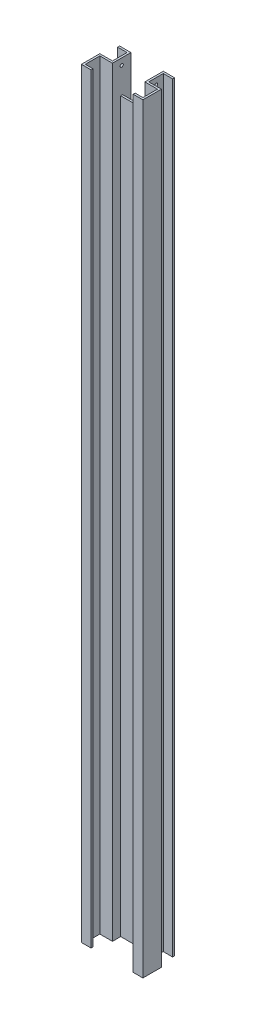
ISO-10303-21;
HEADER;
FILE_DESCRIPTION(('STEP AP214'),'2;1');
FILE_NAME('part.step','',(''),(''),'','','');
FILE_SCHEMA(('AUTOMOTIVE_DESIGN { 1 0 10303 214 1 1 1 1 }'));
ENDSEC;
DATA;
#1=APPLICATION_CONTEXT('core data for automotive mechanical design processes');
#2=APPLICATION_PROTOCOL_DEFINITION('international standard','automotive_design',2000,#1);
#3=PRODUCT_CONTEXT('',#1,'mechanical');
#4=PRODUCT('Part','Part','',(#3));
#5=PRODUCT_RELATED_PRODUCT_CATEGORY('part','',(#4));
#6=PRODUCT_DEFINITION_FORMATION('','',#4);
#7=PRODUCT_DEFINITION_CONTEXT('part definition',#1,'design');
#8=PRODUCT_DEFINITION('design','',#6,#7);
#9=PRODUCT_DEFINITION_SHAPE('','',#8);
#10=(LENGTH_UNIT() NAMED_UNIT(*) SI_UNIT(.MILLI.,.METRE.));
#11=(NAMED_UNIT(*) PLANE_ANGLE_UNIT() SI_UNIT($,.RADIAN.));
#12=(NAMED_UNIT(*) SI_UNIT($,.STERADIAN.) SOLID_ANGLE_UNIT());
#13=UNCERTAINTY_MEASURE_WITH_UNIT(LENGTH_MEASURE(1.E-05),#10,'distance_accuracy_value','');
#14=(GEOMETRIC_REPRESENTATION_CONTEXT(3) GLOBAL_UNCERTAINTY_ASSIGNED_CONTEXT((#13)) GLOBAL_UNIT_ASSIGNED_CONTEXT((#10,
#11,#12)) REPRESENTATION_CONTEXT('',''));
#15=CARTESIAN_POINT('',(0.,0.,0.));
#16=DIRECTION('',(0.,0.,1.));
#17=DIRECTION('',(1.,0.,0.));
#18=AXIS2_PLACEMENT_3D('',#15,#16,#17);
#19=CARTESIAN_POINT('',(-56.,-5.00000001402157E-05,-51.));
#20=DIRECTION('',(1.,0.,0.));
#21=DIRECTION('',(0.,0.,-1.));
#22=AXIS2_PLACEMENT_3D('',#19,#20,#21);
#23=PLANE('',#22);
#24=CARTESIAN_POINT('',(-56.,2330.,-73.5));
#25=DIRECTION('',(-1.,0.,0.));
#26=DIRECTION('',(0.,0.,1.));
#27=AXIS2_PLACEMENT_3D('',#24,#25,#26);
#28=CIRCLE('',#27,4.99999999999989);
#29=CARTESIAN_POINT('',(-56.,2330.,-68.5000000000001));
#30=VERTEX_POINT('',#29);
#31=EDGE_CURVE('E562',#30,#30,#28,.T.);
#32=ORIENTED_EDGE('',*,*,#31,.F.);
#33=EDGE_LOOP('',(#32));
#34=FACE_BOUND('',#33,.T.);
#35=DIRECTION('',(0.,1.,0.));
#36=VECTOR('',#35,1.);
#37=CARTESIAN_POINT('',(-56.,2350.,-96.));
#38=LINE('',#37,#36);
#39=CARTESIAN_POINT('',(-56.,0.,-96.));
#40=VERTEX_POINT('',#39);
#41=CARTESIAN_POINT('',(-56.,2350.,-96.));
#42=VERTEX_POINT('',#41);
#43=EDGE_CURVE('E244',#40,#42,#38,.T.);
#44=ORIENTED_EDGE('',*,*,#43,.F.);
#45=DIRECTION('',(0.,0.,1.));
#46=VECTOR('',#45,1.);
#47=CARTESIAN_POINT('',(-56.,0.,-44.9999999999998));
#48=LINE('',#47,#46);
#49=CARTESIAN_POINT('',(-56.,0.,-51.));
#50=VERTEX_POINT('',#49);
#51=EDGE_CURVE('E259',#40,#50,#48,.T.);
#52=ORIENTED_EDGE('',*,*,#51,.T.);
#53=DIRECTION('',(0.,1.,0.));
#54=VECTOR('',#53,1.);
#55=CARTESIAN_POINT('',(-56.,-5.00000001402157E-05,-51.));
#56=LINE('',#55,#54);
#57=CARTESIAN_POINT('',(-56.,2350.,-51.));
#58=VERTEX_POINT('',#57);
#59=EDGE_CURVE('E257',#50,#58,#56,.T.);
#60=ORIENTED_EDGE('',*,*,#59,.T.);
#61=DIRECTION('',(0.,0.,-1.));
#62=VECTOR('',#61,1.);
#63=CARTESIAN_POINT('',(-56.,2350.,-51.));
#64=LINE('',#63,#62);
#65=EDGE_CURVE('E52',#58,#42,#64,.T.);
#66=ORIENTED_EDGE('',*,*,#65,.T.);
#67=EDGE_LOOP('',(#44,#52,#60,#66));
#68=FACE_BOUND('',#67,.T.);
#69=ADVANCED_FACE('F35',(#34,#68),#23,.F.);
#70=CARTESIAN_POINT('',(0.,0.,-76.5));
#71=DIRECTION('',(0.,0.,-1.));
#72=DIRECTION('',(-1.,0.,0.));
#73=AXIS2_PLACEMENT_3D('',#70,#71,#72);
#74=PLANE('',#73);
#75=DIRECTION('',(-1.,0.,0.));
#76=VECTOR('',#75,1.);
#77=CARTESIAN_POINT('',(95.,0.,-76.5));
#78=LINE('',#77,#76);
#79=CARTESIAN_POINT('',(49.9999999999997,0.,-76.5));
#80=VERTEX_POINT('',#79);
#81=CARTESIAN_POINT('',(-50.0000000000004,0.,-76.5000000000002));
#82=VERTEX_POINT('',#81);
#83=EDGE_CURVE('E424',#80,#82,#78,.T.);
#84=ORIENTED_EDGE('',*,*,#83,.T.);
#85=DIRECTION('',(0.,-1.,0.));
#86=VECTOR('',#85,1.);
#87=CARTESIAN_POINT('',(-50.0000000000004,0.,-76.5000000000002));
#88=LINE('',#87,#86);
#89=CARTESIAN_POINT('',(-50.0000000000004,2250.,-76.5000000000002));
#90=VERTEX_POINT('',#89);
#91=EDGE_CURVE('E264',#90,#82,#88,.T.);
#92=ORIENTED_EDGE('',*,*,#91,.F.);
#93=DIRECTION('',(-1.,0.,0.));
#94=VECTOR('',#93,1.);
#95=CARTESIAN_POINT('',(50.,2250.,-76.5));
#96=LINE('',#95,#94);
#97=CARTESIAN_POINT('',(50.,2250.,-76.5));
#98=VERTEX_POINT('',#97);
#99=EDGE_CURVE('E321',#98,#90,#96,.T.);
#100=ORIENTED_EDGE('',*,*,#99,.F.);
#101=DIRECTION('',(0.,1.,0.));
#102=VECTOR('',#101,1.);
#103=CARTESIAN_POINT('',(49.9999999999997,2350.,-76.4999999999998));
#104=LINE('',#103,#102);
#105=EDGE_CURVE('E304',#80,#98,#104,.T.);
#106=ORIENTED_EDGE('',*,*,#105,.F.);
#107=EDGE_LOOP('',(#84,#92,#100,#106));
#108=FACE_BOUND('',#107,.T.);
#109=ADVANCED_FACE('F513',(#108),#74,.T.);
#110=CARTESIAN_POINT('',(56.,2350.,-51.));
#111=DIRECTION('',(-1.,0.,0.));
#112=DIRECTION('',(0.,0.,1.));
#113=AXIS2_PLACEMENT_3D('',#110,#111,#112);
#114=PLANE('',#113);
#115=CARTESIAN_POINT('',(56.,2330.,-73.5));
#116=DIRECTION('',(-1.,0.,0.));
#117=DIRECTION('',(0.,0.,1.));
#118=AXIS2_PLACEMENT_3D('',#115,#116,#117);
#119=CIRCLE('',#118,4.99999999999989);
#120=CARTESIAN_POINT('',(56.,2330.,-68.5000000000001));
#121=VERTEX_POINT('',#120);
#122=EDGE_CURVE('E565',#121,#121,#119,.T.);
#123=ORIENTED_EDGE('',*,*,#122,.T.);
#124=EDGE_LOOP('',(#123));
#125=FACE_BOUND('',#124,.T.);
#126=DIRECTION('',(0.,-1.,0.));
#127=VECTOR('',#126,1.);
#128=CARTESIAN_POINT('',(56.,0.,-96.));
#129=LINE('',#128,#127);
#130=CARTESIAN_POINT('',(56.,2350.,-96.));
#131=VERTEX_POINT('',#130);
#132=CARTESIAN_POINT('',(56.,0.,-96.));
#133=VERTEX_POINT('',#132);
#134=EDGE_CURVE('E60',#131,#133,#129,.T.);
#135=ORIENTED_EDGE('',*,*,#134,.F.);
#136=DIRECTION('',(0.,0.,-1.));
#137=VECTOR('',#136,1.);
#138=CARTESIAN_POINT('',(56.,2350.,-51.));
#139=LINE('',#138,#137);
#140=CARTESIAN_POINT('',(56.,2350.,-51.));
#141=VERTEX_POINT('',#140);
#142=EDGE_CURVE('E295',#141,#131,#139,.T.);
#143=ORIENTED_EDGE('',*,*,#142,.F.);
#144=DIRECTION('',(0.,-1.,0.));
#145=VECTOR('',#144,1.);
#146=CARTESIAN_POINT('',(56.,2350.,-51.));
#147=LINE('',#146,#145);
#148=CARTESIAN_POINT('',(56.,0.,-51.));
#149=VERTEX_POINT('',#148);
#150=EDGE_CURVE('E302',#141,#149,#147,.T.);
#151=ORIENTED_EDGE('',*,*,#150,.T.);
#152=DIRECTION('',(0.,0.,-1.));
#153=VECTOR('',#152,1.);
#154=CARTESIAN_POINT('',(56.,0.,-51.));
#155=LINE('',#154,#153);
#156=EDGE_CURVE('E296',#149,#133,#155,.T.);
#157=ORIENTED_EDGE('',*,*,#156,.T.);
#158=EDGE_LOOP('',(#135,#143,#151,#157));
#159=FACE_BOUND('',#158,.T.);
#160=ADVANCED_FACE('F486',(#125,#159),#114,.F.);
#161=CARTESIAN_POINT('',(49.9999999999999,2350.,-44.9999999999999));
#162=DIRECTION('',(0.,1.,0.));
#163=DIRECTION('',(0.,0.,1.));
#164=AXIS2_PLACEMENT_3D('',#161,#162,#163);
#165=PLANE('',#164);
#166=ORIENTED_EDGE('',*,*,#142,.T.);
#167=DIRECTION('',(-1.,0.,0.));
#168=VECTOR('',#167,1.);
#169=CARTESIAN_POINT('',(85.,2350.,-96.));
#170=LINE('',#169,#168);
#171=CARTESIAN_POINT('',(85.,2350.,-96.));
#172=VERTEX_POINT('',#171);
#173=EDGE_CURVE('E288',#172,#131,#170,.T.);
#174=ORIENTED_EDGE('',*,*,#173,.F.);
#175=DIRECTION('',(0.,0.,1.));
#176=VECTOR('',#175,1.);
#177=CARTESIAN_POINT('',(85.,2350.,-96.));
#178=LINE('',#177,#176);
#179=CARTESIAN_POINT('',(85.,2350.,-102.));
#180=VERTEX_POINT('',#179);
#181=EDGE_CURVE('E277',#180,#172,#178,.T.);
#182=ORIENTED_EDGE('',*,*,#181,.F.);
#183=DIRECTION('',(1.,0.,0.));
#184=VECTOR('',#183,1.);
#185=CARTESIAN_POINT('',(94.9999999999998,2350.,-102.));
#186=LINE('',#185,#184);
#187=CARTESIAN_POINT('',(49.9999999999998,2350.,-102.));
#188=VERTEX_POINT('',#187);
#189=EDGE_CURVE('E311',#188,#180,#186,.T.);
#190=ORIENTED_EDGE('',*,*,#189,.F.);
#191=DIRECTION('',(0.,0.,-1.));
#192=VECTOR('',#191,1.);
#193=CARTESIAN_POINT('',(49.9999999999999,2350.,-44.9999999999999));
#194=LINE('',#193,#192);
#195=CARTESIAN_POINT('',(49.9999999999999,2350.,-44.9999999999999));
#196=VERTEX_POINT('',#195);
#197=EDGE_CURVE('E44',#196,#188,#194,.T.);
#198=ORIENTED_EDGE('',*,*,#197,.F.);
#199=DIRECTION('',(1.,0.,0.));
#200=VECTOR('',#199,1.);
#201=CARTESIAN_POINT('',(49.9999999999999,2350.,-44.9999999999999));
#202=LINE('',#201,#200);
#203=CARTESIAN_POINT('',(88.9999999999998,2350.,-44.9999999999998));
#204=VERTEX_POINT('',#203);
#205=EDGE_CURVE('E431',#196,#204,#202,.T.);
#206=ORIENTED_EDGE('',*,*,#205,.T.);
#207=DIRECTION('',(0.,0.,-1.));
#208=VECTOR('',#207,1.);
#209=CARTESIAN_POINT('',(88.9999999999998,2350.,6.00000000000016));
#210=LINE('',#209,#208);
#211=CARTESIAN_POINT('',(88.9999999999998,2350.,2.00805084366041E-12));
#212=VERTEX_POINT('',#211);
#213=EDGE_CURVE('E383',#212,#204,#210,.T.);
#214=ORIENTED_EDGE('',*,*,#213,.F.);
#215=DIRECTION('',(1.,0.,0.));
#216=VECTOR('',#215,1.);
#217=CARTESIAN_POINT('',(64.9999999999998,2350.,2.00805084366041E-12));
#218=LINE('',#217,#216);
#219=CARTESIAN_POINT('',(64.9999999999998,2350.,2.00805084366041E-12));
#220=VERTEX_POINT('',#219);
#221=EDGE_CURVE('E372',#220,#212,#218,.T.);
#222=ORIENTED_EDGE('',*,*,#221,.F.);
#223=DIRECTION('',(0.,0.,-1.));
#224=VECTOR('',#223,1.);
#225=CARTESIAN_POINT('',(64.9999999999998,2350.,2.00805084366041E-12));
#226=LINE('',#225,#224);
#227=CARTESIAN_POINT('',(64.9999999999998,2350.,6.));
#228=VERTEX_POINT('',#227);
#229=EDGE_CURVE('E361',#228,#220,#226,.T.);
#230=ORIENTED_EDGE('',*,*,#229,.F.);
#231=DIRECTION('',(-1.,0.,0.));
#232=VECTOR('',#231,1.);
#233=CARTESIAN_POINT('',(88.9999999999998,2350.,6.00000000000016));
#234=LINE('',#233,#232);
#235=CARTESIAN_POINT('',(94.9999999999998,2350.,6.00000000000016));
#236=VERTEX_POINT('',#235);
#237=EDGE_CURVE('E381',#236,#228,#234,.T.);
#238=ORIENTED_EDGE('',*,*,#237,.F.);
#239=DIRECTION('',(0.,0.,-1.));
#240=VECTOR('',#239,1.);
#241=CARTESIAN_POINT('',(95.,2350.,-44.9999999999999));
#242=LINE('',#241,#240);
#243=CARTESIAN_POINT('',(95.,2350.,-51.));
#244=VERTEX_POINT('',#243);
#245=EDGE_CURVE('E11',#236,#244,#242,.T.);
#246=ORIENTED_EDGE('',*,*,#245,.T.);
#247=DIRECTION('',(-1.,0.,0.));
#248=VECTOR('',#247,1.);
#249=CARTESIAN_POINT('',(95.,2350.,-51.));
#250=LINE('',#249,#248);
#251=EDGE_CURVE('E292',#244,#141,#250,.T.);
#252=ORIENTED_EDGE('',*,*,#251,.T.);
#253=EDGE_LOOP('',(#166,#174,#182,#190,#198,#206,#214,#222,#230,#238,#246,#252));
#254=FACE_BOUND('',#253,.T.);
#255=ADVANCED_FACE('F467',(#254),#165,.T.);
#256=CARTESIAN_POINT('',(-95.0000000000001,2350.,-70.4999999999997));
#257=DIRECTION('',(0.,0.,-1.));
#258=DIRECTION('',(-1.,0.,0.));
#259=AXIS2_PLACEMENT_3D('',#256,#257,#258);
#260=PLANE('',#259);
#261=DIRECTION('',(1.,0.,0.));
#262=VECTOR('',#261,1.);
#263=CARTESIAN_POINT('',(-50.,2250.,-70.5));
#264=LINE('',#263,#262);
#265=CARTESIAN_POINT('',(-50.,2250.,-70.5));
#266=VERTEX_POINT('',#265);
#267=CARTESIAN_POINT('',(50.,2250.,-70.5));
#268=VERTEX_POINT('',#267);
#269=EDGE_CURVE('E320',#266,#268,#264,.T.);
#270=ORIENTED_EDGE('',*,*,#269,.F.);
#271=DIRECTION('',(0.,1.,0.));
#272=VECTOR('',#271,1.);
#273=CARTESIAN_POINT('',(-50.,2350.,-70.4999999999997));
#274=LINE('',#273,#272);
#275=CARTESIAN_POINT('',(-50.,0.,-70.4999999999997));
#276=VERTEX_POINT('',#275);
#277=EDGE_CURVE('E389',#276,#266,#274,.T.);
#278=ORIENTED_EDGE('',*,*,#277,.F.);
#279=DIRECTION('',(1.,0.,0.));
#280=VECTOR('',#279,1.);
#281=CARTESIAN_POINT('',(-95.0000000000001,0.,-70.4999999999997));
#282=LINE('',#281,#280);
#283=CARTESIAN_POINT('',(49.9999999999999,0.,-70.4999999999997));
#284=VERTEX_POINT('',#283);
#285=EDGE_CURVE('E410',#276,#284,#282,.T.);
#286=ORIENTED_EDGE('',*,*,#285,.T.);
#287=DIRECTION('',(0.,1.,0.));
#288=VECTOR('',#287,1.);
#289=CARTESIAN_POINT('',(49.9999999999999,2350.,-70.4999999999997));
#290=LINE('',#289,#288);
#291=EDGE_CURVE('E404',#284,#268,#290,.T.);
#292=ORIENTED_EDGE('',*,*,#291,.T.);
#293=EDGE_LOOP('',(#270,#278,#286,#292));
#294=FACE_BOUND('',#293,.T.);
#295=ADVANCED_FACE('F521',(#294),#260,.F.);
#296=CARTESIAN_POINT('',(-50.,2350.,6.00000000000024));
#297=DIRECTION('',(-1.,0.,0.));
#298=DIRECTION('',(0.,0.,1.));
#299=AXIS2_PLACEMENT_3D('',#296,#297,#298);
#300=PLANE('',#299);
#301=CARTESIAN_POINT('',(-50.,2330.,-73.5));
#302=DIRECTION('',(-1.,0.,0.));
#303=DIRECTION('',(0.,0.,1.));
#304=AXIS2_PLACEMENT_3D('',#301,#302,#303);
#305=CIRCLE('',#304,4.99999999999989);
#306=CARTESIAN_POINT('',(-50.,2330.,-68.5000000000001));
#307=VERTEX_POINT('',#306);
#308=EDGE_CURVE('E555',#307,#307,#305,.T.);
#309=ORIENTED_EDGE('',*,*,#308,.T.);
#310=EDGE_LOOP('',(#309));
#311=FACE_BOUND('',#310,.T.);
#312=DIRECTION('',(0.,1.,0.));
#313=VECTOR('',#312,1.);
#314=CARTESIAN_POINT('',(-50.,0.,-45.));
#315=LINE('',#314,#313);
#316=CARTESIAN_POINT('',(-50.,0.,-45.));
#317=VERTEX_POINT('',#316);
#318=CARTESIAN_POINT('',(-50.,2350.,-45.));
#319=VERTEX_POINT('',#318);
#320=EDGE_CURVE('E330',#317,#319,#315,.T.);
#321=ORIENTED_EDGE('',*,*,#320,.F.);
#322=DIRECTION('',(0.,0.,-1.));
#323=VECTOR('',#322,1.);
#324=CARTESIAN_POINT('',(-50.,0.,6.00000000000024));
#325=LINE('',#324,#323);
#326=EDGE_CURVE('E398',#317,#276,#325,.T.);
#327=ORIENTED_EDGE('',*,*,#326,.T.);
#328=ORIENTED_EDGE('',*,*,#277,.T.);
#329=DIRECTION('',(0.,0.,1.));
#330=VECTOR('',#329,1.);
#331=CARTESIAN_POINT('',(-50.0000000000001,2250.,-76.5));
#332=LINE('',#331,#330);
#333=EDGE_CURVE('E318',#90,#266,#332,.T.);
#334=ORIENTED_EDGE('',*,*,#333,.F.);
#335=ORIENTED_EDGE('',*,*,#91,.T.);
#336=DIRECTION('',(0.,0.,1.));
#337=VECTOR('',#336,1.);
#338=CARTESIAN_POINT('',(-50.0000000000003,0.,-102.));
#339=LINE('',#338,#337);
#340=CARTESIAN_POINT('',(-50.0000000000003,0.,-102.));
#341=VERTEX_POINT('',#340);
#342=EDGE_CURVE('E270',#341,#82,#339,.T.);
#343=ORIENTED_EDGE('',*,*,#342,.F.);
#344=DIRECTION('',(0.,-1.,0.));
#345=VECTOR('',#344,1.);
#346=CARTESIAN_POINT('',(-50.0000000000003,0.,-102.));
#347=LINE('',#346,#345);
#348=CARTESIAN_POINT('',(-50.0000000000003,2350.,-102.));
#349=VERTEX_POINT('',#348);
#350=EDGE_CURVE('E266',#349,#341,#347,.T.);
#351=ORIENTED_EDGE('',*,*,#350,.F.);
#352=DIRECTION('',(0.,0.,-1.));
#353=VECTOR('',#352,1.);
#354=CARTESIAN_POINT('',(-50.,2350.,6.00000000000024));
#355=LINE('',#354,#353);
#356=EDGE_CURVE('E402',#319,#349,#355,.T.);
#357=ORIENTED_EDGE('',*,*,#356,.F.);
#358=EDGE_LOOP('',(#321,#327,#328,#334,#335,#343,#351,#357));
#359=FACE_BOUND('',#358,.T.);
#360=ADVANCED_FACE('F517',(#311,#359),#300,.F.);
#361=ORIENTED_EDGE('',*,*,#65,.F.);
#362=DIRECTION('',(1.,0.,0.));
#363=VECTOR('',#362,1.);
#364=CARTESIAN_POINT('',(-95.,2350.,-51.));
#365=LINE('',#364,#363);
#366=CARTESIAN_POINT('',(-95.,2350.,-51.));
#367=VERTEX_POINT('',#366);
#368=EDGE_CURVE('E247',#367,#58,#365,.T.);
#369=ORIENTED_EDGE('',*,*,#368,.F.);
#370=DIRECTION('',(0.,0.,-1.));
#371=VECTOR('',#370,1.);
#372=CARTESIAN_POINT('',(-95.0000000000001,2350.,-76.5000000000003));
#373=LINE('',#372,#371);
#374=CARTESIAN_POINT('',(-95.,2350.,6.00000000000024));
#375=VERTEX_POINT('',#374);
#376=EDGE_CURVE('E405',#375,#367,#373,.T.);
#377=ORIENTED_EDGE('',*,*,#376,.F.);
#378=DIRECTION('',(-1.,0.,0.));
#379=VECTOR('',#378,1.);
#380=CARTESIAN_POINT('',(-95.,2350.,6.00000000000024));
#381=LINE('',#380,#379);
#382=CARTESIAN_POINT('',(-65.,2350.,6.00000000000024));
#383=VERTEX_POINT('',#382);
#384=EDGE_CURVE('E390',#383,#375,#381,.T.);
#385=ORIENTED_EDGE('',*,*,#384,.F.);
#386=DIRECTION('',(0.,0.,1.));
#387=VECTOR('',#386,1.);
#388=CARTESIAN_POINT('',(-65.,2350.,5.27355936696949E-13));
#389=LINE('',#388,#387);
#390=CARTESIAN_POINT('',(-65.,2350.,5.27355936696949E-13));
#391=VERTEX_POINT('',#390);
#392=EDGE_CURVE('E351',#391,#383,#389,.T.);
#393=ORIENTED_EDGE('',*,*,#392,.F.);
#394=DIRECTION('',(-1.,0.,0.));
#395=VECTOR('',#394,1.);
#396=CARTESIAN_POINT('',(-50.,2350.,0.));
#397=LINE('',#396,#395);
#398=CARTESIAN_POINT('',(-89.,2350.,0.));
#399=VERTEX_POINT('',#398);
#400=EDGE_CURVE('E328',#391,#399,#397,.T.);
#401=ORIENTED_EDGE('',*,*,#400,.T.);
#402=DIRECTION('',(0.,0.,1.));
#403=VECTOR('',#402,1.);
#404=CARTESIAN_POINT('',(-89.,2350.,-45.));
#405=LINE('',#404,#403);
#406=CARTESIAN_POINT('',(-89.,2350.,-45.));
#407=VERTEX_POINT('',#406);
#408=EDGE_CURVE('E344',#407,#399,#405,.T.);
#409=ORIENTED_EDGE('',*,*,#408,.F.);
#410=DIRECTION('',(-1.,0.,0.));
#411=VECTOR('',#410,1.);
#412=CARTESIAN_POINT('',(-50.,2350.,-45.));
#413=LINE('',#412,#411);
#414=EDGE_CURVE('E332',#319,#407,#413,.T.);
#415=ORIENTED_EDGE('',*,*,#414,.F.);
#416=ORIENTED_EDGE('',*,*,#356,.T.);
#417=DIRECTION('',(1.,0.,0.));
#418=VECTOR('',#417,1.);
#419=CARTESIAN_POINT('',(-50.0000000000003,2350.,-102.));
#420=LINE('',#419,#418);
#421=CARTESIAN_POINT('',(-85.,2350.,-102.));
#422=VERTEX_POINT('',#421);
#423=EDGE_CURVE('E230',#422,#349,#420,.T.);
#424=ORIENTED_EDGE('',*,*,#423,.F.);
#425=DIRECTION('',(0.,0.,-1.));
#426=VECTOR('',#425,1.);
#427=CARTESIAN_POINT('',(-85.,2350.,-102.));
#428=LINE('',#427,#426);
#429=CARTESIAN_POINT('',(-85.,2350.,-96.));
#430=VERTEX_POINT('',#429);
#431=EDGE_CURVE('E223',#430,#422,#428,.T.);
#432=ORIENTED_EDGE('',*,*,#431,.F.);
#433=DIRECTION('',(1.,0.,0.));
#434=VECTOR('',#433,1.);
#435=CARTESIAN_POINT('',(-85.,2350.,-96.));
#436=LINE('',#435,#434);
#437=EDGE_CURVE('E227',#430,#42,#436,.T.);
#438=ORIENTED_EDGE('',*,*,#437,.T.);
#439=EDGE_LOOP('',(#361,#369,#377,#385,#393,#401,#409,#415,#416,#424,#432,#438));
#440=FACE_BOUND('',#439,.T.);
#441=ADVANCED_FACE('F225',(#440),#165,.T.);
#442=CARTESIAN_POINT('',(95.,0.,-44.9999999999999));
#443=DIRECTION('',(0.,-1.,0.));
#444=DIRECTION('',(0.,0.,-1.));
#445=AXIS2_PLACEMENT_3D('',#442,#443,#444);
#446=PLANE('',#445);
#447=ORIENTED_EDGE('',*,*,#51,.F.);
#448=DIRECTION('',(1.,0.,0.));
#449=VECTOR('',#448,1.);
#450=CARTESIAN_POINT('',(-85.,0.,-96.));
#451=LINE('',#450,#449);
#452=CARTESIAN_POINT('',(-85.,0.,-96.));
#453=VERTEX_POINT('',#452);
#454=EDGE_CURVE('E248',#453,#40,#451,.T.);
#455=ORIENTED_EDGE('',*,*,#454,.F.);
#456=DIRECTION('',(0.,0.,1.));
#457=VECTOR('',#456,1.);
#458=CARTESIAN_POINT('',(-85.,0.,-96.));
#459=LINE('',#458,#457);
#460=CARTESIAN_POINT('',(-85.,0.,-102.));
#461=VERTEX_POINT('',#460);
#462=EDGE_CURVE('E240',#461,#453,#459,.T.);
#463=ORIENTED_EDGE('',*,*,#462,.F.);
#464=DIRECTION('',(-1.,0.,0.));
#465=VECTOR('',#464,1.);
#466=CARTESIAN_POINT('',(-95.0000000000003,0.,-102.));
#467=LINE('',#466,#465);
#468=EDGE_CURVE('E268',#341,#461,#467,.T.);
#469=ORIENTED_EDGE('',*,*,#468,.F.);
#470=ORIENTED_EDGE('',*,*,#342,.T.);
#471=ORIENTED_EDGE('',*,*,#83,.F.);
#472=DIRECTION('',(0.,0.,1.));
#473=VECTOR('',#472,1.);
#474=CARTESIAN_POINT('',(49.9999999999998,0.,-102.));
#475=LINE('',#474,#473);
#476=CARTESIAN_POINT('',(49.9999999999998,0.,-102.));
#477=VERTEX_POINT('',#476);
#478=EDGE_CURVE('E313',#477,#80,#475,.T.);
#479=ORIENTED_EDGE('',*,*,#478,.F.);
#480=DIRECTION('',(-1.,0.,0.));
#481=VECTOR('',#480,1.);
#482=CARTESIAN_POINT('',(49.9999999999998,0.,-102.));
#483=LINE('',#482,#481);
#484=CARTESIAN_POINT('',(85.,0.,-102.));
#485=VERTEX_POINT('',#484);
#486=EDGE_CURVE('E306',#485,#477,#483,.T.);
#487=ORIENTED_EDGE('',*,*,#486,.F.);
#488=DIRECTION('',(0.,0.,-1.));
#489=VECTOR('',#488,1.);
#490=CARTESIAN_POINT('',(85.,0.,-102.));
#491=LINE('',#490,#489);
#492=CARTESIAN_POINT('',(85.,0.,-96.));
#493=VERTEX_POINT('',#492);
#494=EDGE_CURVE('E281',#493,#485,#491,.T.);
#495=ORIENTED_EDGE('',*,*,#494,.F.);
#496=DIRECTION('',(-1.,0.,0.));
#497=VECTOR('',#496,1.);
#498=CARTESIAN_POINT('',(85.,0.,-96.));
#499=LINE('',#498,#497);
#500=EDGE_CURVE('E284',#493,#133,#499,.T.);
#501=ORIENTED_EDGE('',*,*,#500,.T.);
#502=ORIENTED_EDGE('',*,*,#156,.F.);
#503=DIRECTION('',(-1.,0.,0.));
#504=VECTOR('',#503,1.);
#505=CARTESIAN_POINT('',(95.,0.,-51.));
#506=LINE('',#505,#504);
#507=CARTESIAN_POINT('',(95.,0.,-51.));
#508=VERTEX_POINT('',#507);
#509=EDGE_CURVE('E291',#508,#149,#506,.T.);
#510=ORIENTED_EDGE('',*,*,#509,.F.);
#511=DIRECTION('',(0.,0.,-1.));
#512=VECTOR('',#511,1.);
#513=CARTESIAN_POINT('',(95.,0.,-44.9999999999999));
#514=LINE('',#513,#512);
#515=CARTESIAN_POINT('',(94.9999999999998,0.,6.00000000000016));
#516=VERTEX_POINT('',#515);
#517=EDGE_CURVE('E436',#516,#508,#514,.T.);
#518=ORIENTED_EDGE('',*,*,#517,.F.);
#519=DIRECTION('',(1.,0.,0.));
#520=VECTOR('',#519,1.);
#521=CARTESIAN_POINT('',(94.9999999999998,0.,6.00000000000016));
#522=LINE('',#521,#520);
#523=CARTESIAN_POINT('',(64.9999999999998,0.,6.));
#524=VERTEX_POINT('',#523);
#525=EDGE_CURVE('E375',#524,#516,#522,.T.);
#526=ORIENTED_EDGE('',*,*,#525,.F.);
#527=DIRECTION('',(0.,0.,1.));
#528=VECTOR('',#527,1.);
#529=CARTESIAN_POINT('',(64.9999999999998,0.,6.));
#530=LINE('',#529,#528);
#531=CARTESIAN_POINT('',(64.9999999999998,0.,2.00805084366041E-12));
#532=VERTEX_POINT('',#531);
#533=EDGE_CURVE('E365',#532,#524,#530,.T.);
#534=ORIENTED_EDGE('',*,*,#533,.F.);
#535=DIRECTION('',(1.,0.,0.));
#536=VECTOR('',#535,1.);
#537=CARTESIAN_POINT('',(64.9999999999998,0.,2.00805084366041E-12));
#538=LINE('',#537,#536);
#539=CARTESIAN_POINT('',(88.9999999999998,0.,2.00805084366041E-12));
#540=VERTEX_POINT('',#539);
#541=EDGE_CURVE('E368',#532,#540,#538,.T.);
#542=ORIENTED_EDGE('',*,*,#541,.T.);
#543=DIRECTION('',(0.,0.,-1.));
#544=VECTOR('',#543,1.);
#545=CARTESIAN_POINT('',(88.9999999999998,0.,6.00000000000016));
#546=LINE('',#545,#544);
#547=CARTESIAN_POINT('',(88.9999999999998,0.,-44.9999999999998));
#548=VERTEX_POINT('',#547);
#549=EDGE_CURVE('E387',#540,#548,#546,.T.);
#550=ORIENTED_EDGE('',*,*,#549,.T.);
#551=DIRECTION('',(-1.,0.,0.));
#552=VECTOR('',#551,1.);
#553=CARTESIAN_POINT('',(95.,0.,-44.9999999999999));
#554=LINE('',#553,#552);
#555=CARTESIAN_POINT('',(49.9999999999999,0.,-44.9999999999999));
#556=VERTEX_POINT('',#555);
#557=EDGE_CURVE('E413',#548,#556,#554,.T.);
#558=ORIENTED_EDGE('',*,*,#557,.T.);
#559=DIRECTION('',(0.,0.,-1.));
#560=VECTOR('',#559,1.);
#561=CARTESIAN_POINT('',(49.9999999999999,0.,-44.9999999999999));
#562=LINE('',#561,#560);
#563=EDGE_CURVE('E437',#556,#284,#562,.T.);
#564=ORIENTED_EDGE('',*,*,#563,.T.);
#565=ORIENTED_EDGE('',*,*,#285,.F.);
#566=ORIENTED_EDGE('',*,*,#326,.F.);
#567=DIRECTION('',(1.,0.,0.));
#568=VECTOR('',#567,1.);
#569=CARTESIAN_POINT('',(-89.,0.,-45.));
#570=LINE('',#569,#568);
#571=CARTESIAN_POINT('',(-89.,0.,-45.));
#572=VERTEX_POINT('',#571);
#573=EDGE_CURVE('E327',#572,#317,#570,.T.);
#574=ORIENTED_EDGE('',*,*,#573,.F.);
#575=DIRECTION('',(0.,0.,1.));
#576=VECTOR('',#575,1.);
#577=CARTESIAN_POINT('',(-89.,0.,-45.));
#578=LINE('',#577,#576);
#579=CARTESIAN_POINT('',(-89.,0.,0.));
#580=VERTEX_POINT('',#579);
#581=EDGE_CURVE('E335',#572,#580,#578,.T.);
#582=ORIENTED_EDGE('',*,*,#581,.T.);
#583=DIRECTION('',(1.,0.,0.));
#584=VECTOR('',#583,1.);
#585=CARTESIAN_POINT('',(-89.,0.,0.));
#586=LINE('',#585,#584);
#587=CARTESIAN_POINT('',(-65.,0.,0.));
#588=VERTEX_POINT('',#587);
#589=EDGE_CURVE('E339',#580,#588,#586,.T.);
#590=ORIENTED_EDGE('',*,*,#589,.T.);
#591=DIRECTION('',(0.,0.,1.));
#592=VECTOR('',#591,1.);
#593=CARTESIAN_POINT('',(-65.,0.,5.27355936696949E-13));
#594=LINE('',#593,#592);
#595=CARTESIAN_POINT('',(-65.,0.,6.00000000000024));
#596=VERTEX_POINT('',#595);
#597=EDGE_CURVE('E353',#588,#596,#594,.T.);
#598=ORIENTED_EDGE('',*,*,#597,.T.);
#599=DIRECTION('',(1.,0.,0.));
#600=VECTOR('',#599,1.);
#601=CARTESIAN_POINT('',(-50.,0.,6.00000000000024));
#602=LINE('',#601,#600);
#603=CARTESIAN_POINT('',(-95.,0.,6.00000000000024));
#604=VERTEX_POINT('',#603);
#605=EDGE_CURVE('E395',#604,#596,#602,.T.);
#606=ORIENTED_EDGE('',*,*,#605,.F.);
#607=DIRECTION('',(0.,0.,1.));
#608=VECTOR('',#607,1.);
#609=CARTESIAN_POINT('',(-95.0000000000001,0.,-70.4999999999997));
#610=LINE('',#609,#608);
#611=CARTESIAN_POINT('',(-95.,0.,-51.));
#612=VERTEX_POINT('',#611);
#613=EDGE_CURVE('E408',#612,#604,#610,.T.);
#614=ORIENTED_EDGE('',*,*,#613,.F.);
#615=DIRECTION('',(-1.,0.,0.));
#616=VECTOR('',#615,1.);
#617=CARTESIAN_POINT('',(95.,0.,-51.));
#618=LINE('',#617,#616);
#619=EDGE_CURVE('E262',#50,#612,#618,.T.);
#620=ORIENTED_EDGE('',*,*,#619,.F.);
#621=EDGE_LOOP('',(#447,#455,#463,#469,#470,#471,#479,#487,#495,#501,#502,#510,#518,#526,#534,
#542,#550,#558,#564,#565,#566,#574,#582,#590,#598,#606,#614,#620));
#622=FACE_BOUND('',#621,.T.);
#623=ADVANCED_FACE('F455',(#622),#446,.T.);
#624=CARTESIAN_POINT('',(88.9999999999998,0.,6.00000000000016));
#625=DIRECTION('',(1.,0.,0.));
#626=DIRECTION('',(0.,0.,-1.));
#627=AXIS2_PLACEMENT_3D('',#624,#625,#626);
#628=PLANE('',#627);
#629=DIRECTION('',(0.,-1.,0.));
#630=VECTOR('',#629,1.);
#631=CARTESIAN_POINT('',(88.9999999999998,0.,2.00805084366041E-12));
#632=LINE('',#631,#630);
#633=EDGE_CURVE('E356',#212,#540,#632,.T.);
#634=ORIENTED_EDGE('',*,*,#633,.F.);
#635=ORIENTED_EDGE('',*,*,#213,.T.);
#636=DIRECTION('',(0.,-1.,0.));
#637=VECTOR('',#636,1.);
#638=CARTESIAN_POINT('',(88.9999999999998,0.,-44.9999999999998));
#639=LINE('',#638,#637);
#640=EDGE_CURVE('E374',#204,#548,#639,.T.);
#641=ORIENTED_EDGE('',*,*,#640,.T.);
#642=ORIENTED_EDGE('',*,*,#549,.F.);
#643=EDGE_LOOP('',(#634,#635,#641,#642));
#644=FACE_BOUND('',#643,.T.);
#645=ADVANCED_FACE('F465',(#644),#628,.F.);
#646=CARTESIAN_POINT('',(0.,0.,-44.9999999999998));
#647=DIRECTION('',(0.,0.,-1.));
#648=DIRECTION('',(-1.,0.,0.));
#649=AXIS2_PLACEMENT_3D('',#646,#647,#648);
#650=PLANE('',#649);
#651=ORIENTED_EDGE('',*,*,#640,.F.);
#652=ORIENTED_EDGE('',*,*,#205,.F.);
#653=DIRECTION('',(0.,1.,0.));
#654=VECTOR('',#653,1.);
#655=CARTESIAN_POINT('',(49.9999999999999,0.,-44.9999999999999));
#656=LINE('',#655,#654);
#657=EDGE_CURVE('E447',#556,#196,#656,.T.);
#658=ORIENTED_EDGE('',*,*,#657,.F.);
#659=ORIENTED_EDGE('',*,*,#557,.F.);
#660=EDGE_LOOP('',(#651,#652,#658,#659));
#661=FACE_BOUND('',#660,.T.);
#662=ADVANCED_FACE('F462',(#661),#650,.F.);
#663=CARTESIAN_POINT('',(95.,2350.,-44.9999999999999));
#664=DIRECTION('',(1.,0.,0.));
#665=DIRECTION('',(0.,0.,-1.));
#666=AXIS2_PLACEMENT_3D('',#663,#664,#665);
#667=PLANE('',#666);
#668=DIRECTION('',(0.,-1.,0.));
#669=VECTOR('',#668,1.);
#670=CARTESIAN_POINT('',(95.,2350.,-51.));
#671=LINE('',#670,#669);
#672=EDGE_CURVE('E298',#244,#508,#671,.T.);
#673=ORIENTED_EDGE('',*,*,#672,.F.);
#674=ORIENTED_EDGE('',*,*,#245,.F.);
#675=DIRECTION('',(0.,1.,0.));
#676=VECTOR('',#675,1.);
#677=CARTESIAN_POINT('',(94.9999999999998,2350.,6.00000000000016));
#678=LINE('',#677,#676);
#679=EDGE_CURVE('E378',#516,#236,#678,.T.);
#680=ORIENTED_EDGE('',*,*,#679,.F.);
#681=ORIENTED_EDGE('',*,*,#517,.T.);
#682=EDGE_LOOP('',(#673,#674,#680,#681));
#683=FACE_BOUND('',#682,.T.);
#684=ADVANCED_FACE('F37',(#683),#667,.T.);
#685=CARTESIAN_POINT('',(49.9999999999999,0.,-44.9999999999999));
#686=DIRECTION('',(-1.,0.,0.));
#687=DIRECTION('',(0.,0.,1.));
#688=AXIS2_PLACEMENT_3D('',#685,#686,#687);
#689=PLANE('',#688);
#690=CARTESIAN_POINT('',(49.9999999999999,2330.,-73.5));
#691=DIRECTION('',(-1.,0.,0.));
#692=DIRECTION('',(0.,0.,1.));
#693=AXIS2_PLACEMENT_3D('',#690,#691,#692);
#694=CIRCLE('',#693,4.99999999999989);
#695=CARTESIAN_POINT('',(49.9999999999999,2330.,-68.5000000000001));
#696=VERTEX_POINT('',#695);
#697=EDGE_CURVE('E568',#696,#696,#694,.T.);
#698=ORIENTED_EDGE('',*,*,#697,.F.);
#699=EDGE_LOOP('',(#698));
#700=FACE_BOUND('',#699,.T.);
#701=ORIENTED_EDGE('',*,*,#291,.F.);
#702=ORIENTED_EDGE('',*,*,#563,.F.);
#703=ORIENTED_EDGE('',*,*,#657,.T.);
#704=ORIENTED_EDGE('',*,*,#197,.T.);
#705=DIRECTION('',(0.,1.,0.));
#706=VECTOR('',#705,1.);
#707=CARTESIAN_POINT('',(49.9999999999998,2350.,-102.));
#708=LINE('',#707,#706);
#709=EDGE_CURVE('E308',#477,#188,#708,.T.);
#710=ORIENTED_EDGE('',*,*,#709,.F.);
#711=ORIENTED_EDGE('',*,*,#478,.T.);
#712=ORIENTED_EDGE('',*,*,#105,.T.);
#713=DIRECTION('',(0.,0.,-1.));
#714=VECTOR('',#713,1.);
#715=CARTESIAN_POINT('',(50.,2250.,-70.5));
#716=LINE('',#715,#714);
#717=EDGE_CURVE('E323',#268,#98,#716,.T.);
#718=ORIENTED_EDGE('',*,*,#717,.F.);
#719=EDGE_LOOP('',(#701,#702,#703,#704,#710,#711,#712,#718));
#720=FACE_BOUND('',#719,.T.);
#721=ADVANCED_FACE('F460',(#700,#720),#689,.T.);
#722=CARTESIAN_POINT('',(-95.,0.,0.));
#723=DIRECTION('',(1.,0.,0.));
#724=DIRECTION('',(0.,0.,-1.));
#725=AXIS2_PLACEMENT_3D('',#722,#723,#724);
#726=PLANE('',#725);
#727=ORIENTED_EDGE('',*,*,#376,.T.);
#728=DIRECTION('',(0.,1.,0.));
#729=VECTOR('',#728,1.);
#730=CARTESIAN_POINT('',(-95.,-5.00000001402157E-05,-51.));
#731=LINE('',#730,#729);
#732=EDGE_CURVE('E256',#612,#367,#731,.T.);
#733=ORIENTED_EDGE('',*,*,#732,.F.);
#734=ORIENTED_EDGE('',*,*,#613,.T.);
#735=DIRECTION('',(0.,-1.,0.));
#736=VECTOR('',#735,1.);
#737=CARTESIAN_POINT('',(-95.,0.,6.00000000000024));
#738=LINE('',#737,#736);
#739=EDGE_CURVE('E392',#375,#604,#738,.T.);
#740=ORIENTED_EDGE('',*,*,#739,.F.);
#741=EDGE_LOOP('',(#727,#733,#734,#740));
#742=FACE_BOUND('',#741,.T.);
#743=ADVANCED_FACE('F549',(#742),#726,.F.);
#744=CARTESIAN_POINT('',(0.,0.,6.00000000000024));
#745=DIRECTION('',(0.,0.,-1.));
#746=DIRECTION('',(-1.,0.,0.));
#747=AXIS2_PLACEMENT_3D('',#744,#745,#746);
#748=PLANE('',#747);
#749=ORIENTED_EDGE('',*,*,#605,.T.);
#750=DIRECTION('',(0.,-1.,0.));
#751=VECTOR('',#750,1.);
#752=CARTESIAN_POINT('',(-65.,2350.,6.00000000000024));
#753=LINE('',#752,#751);
#754=EDGE_CURVE('E346',#383,#596,#753,.T.);
#755=ORIENTED_EDGE('',*,*,#754,.F.);
#756=ORIENTED_EDGE('',*,*,#384,.T.);
#757=ORIENTED_EDGE('',*,*,#739,.T.);
#758=EDGE_LOOP('',(#749,#755,#756,#757));
#759=FACE_BOUND('',#758,.T.);
#760=ADVANCED_FACE('F543',(#759),#748,.F.);
#761=CARTESIAN_POINT('',(0.,0.,6.00000000000016));
#762=DIRECTION('',(0.,0.,-1.));
#763=DIRECTION('',(-1.,0.,0.));
#764=AXIS2_PLACEMENT_3D('',#761,#762,#763);
#765=PLANE('',#764);
#766=ORIENTED_EDGE('',*,*,#237,.T.);
#767=DIRECTION('',(0.,1.,0.));
#768=VECTOR('',#767,1.);
#769=CARTESIAN_POINT('',(64.9999999999998,2350.,6.));
#770=LINE('',#769,#768);
#771=EDGE_CURVE('E358',#524,#228,#770,.T.);
#772=ORIENTED_EDGE('',*,*,#771,.F.);
#773=ORIENTED_EDGE('',*,*,#525,.T.);
#774=ORIENTED_EDGE('',*,*,#679,.T.);
#775=EDGE_LOOP('',(#766,#772,#773,#774));
#776=FACE_BOUND('',#775,.T.);
#777=ADVANCED_FACE('F479',(#776),#765,.F.);
#778=CARTESIAN_POINT('',(64.9999999999998,0.,2.00805084366041E-12));
#779=DIRECTION('',(0.,0.,1.));
#780=DIRECTION('',(1.,0.,0.));
#781=AXIS2_PLACEMENT_3D('',#778,#779,#780);
#782=PLANE('',#781);
#783=ORIENTED_EDGE('',*,*,#633,.T.);
#784=ORIENTED_EDGE('',*,*,#541,.F.);
#785=DIRECTION('',(0.,-1.,0.));
#786=VECTOR('',#785,1.);
#787=CARTESIAN_POINT('',(64.9999999999998,0.,2.00805084366041E-12));
#788=LINE('',#787,#786);
#789=EDGE_CURVE('E363',#220,#532,#788,.T.);
#790=ORIENTED_EDGE('',*,*,#789,.F.);
#791=ORIENTED_EDGE('',*,*,#221,.T.);
#792=EDGE_LOOP('',(#783,#784,#790,#791));
#793=FACE_BOUND('',#792,.T.);
#794=ADVANCED_FACE('F473',(#793),#782,.F.);
#795=CARTESIAN_POINT('',(64.9999999999998,0.,0.));
#796=DIRECTION('',(1.,0.,0.));
#797=DIRECTION('',(0.,0.,-1.));
#798=AXIS2_PLACEMENT_3D('',#795,#796,#797);
#799=PLANE('',#798);
#800=ORIENTED_EDGE('',*,*,#771,.T.);
#801=ORIENTED_EDGE('',*,*,#229,.T.);
#802=ORIENTED_EDGE('',*,*,#789,.T.);
#803=ORIENTED_EDGE('',*,*,#533,.T.);
#804=EDGE_LOOP('',(#800,#801,#802,#803));
#805=FACE_BOUND('',#804,.T.);
#806=ADVANCED_FACE('F476',(#805),#799,.F.);
#807=CARTESIAN_POINT('',(-65.,2350.,5.27355936696949E-13));
#808=DIRECTION('',(-1.,0.,0.));
#809=DIRECTION('',(0.,0.,1.));
#810=AXIS2_PLACEMENT_3D('',#807,#808,#809);
#811=PLANE('',#810);
#812=ORIENTED_EDGE('',*,*,#754,.T.);
#813=ORIENTED_EDGE('',*,*,#597,.F.);
#814=DIRECTION('',(0.,-1.,0.));
#815=VECTOR('',#814,1.);
#816=CARTESIAN_POINT('',(-65.,2350.,5.27355936696949E-13));
#817=LINE('',#816,#815);
#818=EDGE_CURVE('E349',#391,#588,#817,.T.);
#819=ORIENTED_EDGE('',*,*,#818,.F.);
#820=ORIENTED_EDGE('',*,*,#392,.T.);
#821=EDGE_LOOP('',(#812,#813,#819,#820));
#822=FACE_BOUND('',#821,.T.);
#823=ADVANCED_FACE('F539',(#822),#811,.F.);
#824=CARTESIAN_POINT('',(0.,0.,0.));
#825=DIRECTION('',(0.,0.,1.));
#826=DIRECTION('',(1.,0.,0.));
#827=AXIS2_PLACEMENT_3D('',#824,#825,#826);
#828=PLANE('',#827);
#829=ORIENTED_EDGE('',*,*,#589,.F.);
#830=DIRECTION('',(0.,-1.,0.));
#831=VECTOR('',#830,1.);
#832=CARTESIAN_POINT('',(-89.,2350.,0.));
#833=LINE('',#832,#831);
#834=EDGE_CURVE('E336',#399,#580,#833,.T.);
#835=ORIENTED_EDGE('',*,*,#834,.F.);
#836=ORIENTED_EDGE('',*,*,#400,.F.);
#837=ORIENTED_EDGE('',*,*,#818,.T.);
#838=EDGE_LOOP('',(#829,#835,#836,#837));
#839=FACE_BOUND('',#838,.T.);
#840=ADVANCED_FACE('F534',(#839),#828,.F.);
#841=CARTESIAN_POINT('',(-89.,2350.,-45.));
#842=DIRECTION('',(-1.,0.,0.));
#843=DIRECTION('',(0.,0.,1.));
#844=AXIS2_PLACEMENT_3D('',#841,#842,#843);
#845=PLANE('',#844);
#846=ORIENTED_EDGE('',*,*,#834,.T.);
#847=ORIENTED_EDGE('',*,*,#581,.F.);
#848=DIRECTION('',(0.,-1.,0.));
#849=VECTOR('',#848,1.);
#850=CARTESIAN_POINT('',(-89.,2350.,-45.));
#851=LINE('',#850,#849);
#852=EDGE_CURVE('E324',#407,#572,#851,.T.);
#853=ORIENTED_EDGE('',*,*,#852,.F.);
#854=ORIENTED_EDGE('',*,*,#408,.T.);
#855=EDGE_LOOP('',(#846,#847,#853,#854));
#856=FACE_BOUND('',#855,.T.);
#857=ADVANCED_FACE('F532',(#856),#845,.F.);
#858=CARTESIAN_POINT('',(0.,0.,-45.));
#859=DIRECTION('',(0.,0.,1.));
#860=DIRECTION('',(1.,0.,0.));
#861=AXIS2_PLACEMENT_3D('',#858,#859,#860);
#862=PLANE('',#861);
#863=ORIENTED_EDGE('',*,*,#852,.T.);
#864=ORIENTED_EDGE('',*,*,#573,.T.);
#865=ORIENTED_EDGE('',*,*,#320,.T.);
#866=ORIENTED_EDGE('',*,*,#414,.T.);
#867=EDGE_LOOP('',(#863,#864,#865,#866));
#868=FACE_BOUND('',#867,.T.);
#869=ADVANCED_FACE('F524',(#868),#862,.T.);
#870=CARTESIAN_POINT('',(0.,2250.,0.));
#871=DIRECTION('',(0.,1.,0.));
#872=DIRECTION('',(0.,0.,1.));
#873=AXIS2_PLACEMENT_3D('',#870,#871,#872);
#874=PLANE('',#873);
#875=ORIENTED_EDGE('',*,*,#99,.T.);
#876=ORIENTED_EDGE('',*,*,#333,.T.);
#877=ORIENTED_EDGE('',*,*,#269,.T.);
#878=ORIENTED_EDGE('',*,*,#717,.T.);
#879=EDGE_LOOP('',(#875,#876,#877,#878));
#880=FACE_BOUND('',#879,.T.);
#881=ADVANCED_FACE('F509',(#880),#874,.T.);
#882=CARTESIAN_POINT('',(3.77475828372553E-13,0.,-102.));
#883=DIRECTION('',(0.,0.,1.));
#884=DIRECTION('',(1.,0.,0.));
#885=AXIS2_PLACEMENT_3D('',#882,#883,#884);
#886=PLANE('',#885);
#887=ORIENTED_EDGE('',*,*,#189,.T.);
#888=DIRECTION('',(0.,1.,0.));
#889=VECTOR('',#888,1.);
#890=CARTESIAN_POINT('',(85.,2350.,-102.));
#891=LINE('',#890,#889);
#892=EDGE_CURVE('E274',#485,#180,#891,.T.);
#893=ORIENTED_EDGE('',*,*,#892,.F.);
#894=ORIENTED_EDGE('',*,*,#486,.T.);
#895=ORIENTED_EDGE('',*,*,#709,.T.);
#896=EDGE_LOOP('',(#887,#893,#894,#895));
#897=FACE_BOUND('',#896,.T.);
#898=ADVANCED_FACE('F497',(#897),#886,.F.);
#899=CARTESIAN_POINT('',(95.,2350.,-51.));
#900=DIRECTION('',(0.,0.,1.));
#901=DIRECTION('',(1.,0.,0.));
#902=AXIS2_PLACEMENT_3D('',#899,#900,#901);
#903=PLANE('',#902);
#904=ORIENTED_EDGE('',*,*,#509,.T.);
#905=ORIENTED_EDGE('',*,*,#150,.F.);
#906=ORIENTED_EDGE('',*,*,#251,.F.);
#907=ORIENTED_EDGE('',*,*,#672,.T.);
#908=EDGE_LOOP('',(#904,#905,#906,#907));
#909=FACE_BOUND('',#908,.T.);
#910=ADVANCED_FACE('F482',(#909),#903,.F.);
#911=CARTESIAN_POINT('',(85.,0.,-96.));
#912=DIRECTION('',(0.,0.,-1.));
#913=DIRECTION('',(-1.,0.,0.));
#914=AXIS2_PLACEMENT_3D('',#911,#912,#913);
#915=PLANE('',#914);
#916=ORIENTED_EDGE('',*,*,#134,.T.);
#917=ORIENTED_EDGE('',*,*,#500,.F.);
#918=DIRECTION('',(0.,-1.,0.));
#919=VECTOR('',#918,1.);
#920=CARTESIAN_POINT('',(85.,0.,-96.));
#921=LINE('',#920,#919);
#922=EDGE_CURVE('E279',#172,#493,#921,.T.);
#923=ORIENTED_EDGE('',*,*,#922,.F.);
#924=ORIENTED_EDGE('',*,*,#173,.T.);
#925=EDGE_LOOP('',(#916,#917,#923,#924));
#926=FACE_BOUND('',#925,.T.);
#927=ADVANCED_FACE('F488',(#926),#915,.F.);
#928=CARTESIAN_POINT('',(85.,0.,0.));
#929=DIRECTION('',(-1.,0.,0.));
#930=DIRECTION('',(0.,0.,1.));
#931=AXIS2_PLACEMENT_3D('',#928,#929,#930);
#932=PLANE('',#931);
#933=ORIENTED_EDGE('',*,*,#892,.T.);
#934=ORIENTED_EDGE('',*,*,#181,.T.);
#935=ORIENTED_EDGE('',*,*,#922,.T.);
#936=ORIENTED_EDGE('',*,*,#494,.T.);
#937=EDGE_LOOP('',(#933,#934,#935,#936));
#938=FACE_BOUND('',#937,.T.);
#939=ADVANCED_FACE('F495',(#938),#932,.F.);
#940=CARTESIAN_POINT('',(3.77475828372553E-13,0.,-102.));
#941=DIRECTION('',(0.,0.,1.));
#942=DIRECTION('',(1.,0.,0.));
#943=AXIS2_PLACEMENT_3D('',#940,#941,#942);
#944=PLANE('',#943);
#945=ORIENTED_EDGE('',*,*,#468,.T.);
#946=DIRECTION('',(0.,-1.,0.));
#947=VECTOR('',#946,1.);
#948=CARTESIAN_POINT('',(-85.,0.,-102.));
#949=LINE('',#948,#947);
#950=EDGE_CURVE('E234',#422,#461,#949,.T.);
#951=ORIENTED_EDGE('',*,*,#950,.F.);
#952=ORIENTED_EDGE('',*,*,#423,.T.);
#953=ORIENTED_EDGE('',*,*,#350,.T.);
#954=EDGE_LOOP('',(#945,#951,#952,#953));
#955=FACE_BOUND('',#954,.T.);
#956=ADVANCED_FACE('F596',(#955),#944,.F.);
#957=CARTESIAN_POINT('',(-95.,-5.00000001402157E-05,-51.));
#958=DIRECTION('',(0.,0.,1.));
#959=DIRECTION('',(1.,0.,0.));
#960=AXIS2_PLACEMENT_3D('',#957,#958,#959);
#961=PLANE('',#960);
#962=ORIENTED_EDGE('',*,*,#619,.T.);
#963=ORIENTED_EDGE('',*,*,#732,.T.);
#964=ORIENTED_EDGE('',*,*,#368,.T.);
#965=ORIENTED_EDGE('',*,*,#59,.F.);
#966=EDGE_LOOP('',(#962,#963,#964,#965));
#967=FACE_BOUND('',#966,.T.);
#968=ADVANCED_FACE('F554',(#967),#961,.F.);
#969=CARTESIAN_POINT('',(-85.,2350.,-96.));
#970=DIRECTION('',(0.,0.,-1.));
#971=DIRECTION('',(-1.,0.,0.));
#972=AXIS2_PLACEMENT_3D('',#969,#970,#971);
#973=PLANE('',#972);
#974=ORIENTED_EDGE('',*,*,#43,.T.);
#975=ORIENTED_EDGE('',*,*,#437,.F.);
#976=DIRECTION('',(0.,1.,0.));
#977=VECTOR('',#976,1.);
#978=CARTESIAN_POINT('',(-85.,2350.,-96.));
#979=LINE('',#978,#977);
#980=EDGE_CURVE('E235',#453,#430,#979,.T.);
#981=ORIENTED_EDGE('',*,*,#980,.F.);
#982=ORIENTED_EDGE('',*,*,#454,.T.);
#983=EDGE_LOOP('',(#974,#975,#981,#982));
#984=FACE_BOUND('',#983,.T.);
#985=ADVANCED_FACE('F246',(#984),#973,.F.);
#986=CARTESIAN_POINT('',(-85.,0.,0.));
#987=DIRECTION('',(1.,0.,0.));
#988=DIRECTION('',(0.,0.,-1.));
#989=AXIS2_PLACEMENT_3D('',#986,#987,#988);
#990=PLANE('',#989);
#991=ORIENTED_EDGE('',*,*,#980,.T.);
#992=ORIENTED_EDGE('',*,*,#431,.T.);
#993=ORIENTED_EDGE('',*,*,#950,.T.);
#994=ORIENTED_EDGE('',*,*,#462,.T.);
#995=EDGE_LOOP('',(#991,#992,#993,#994));
#996=FACE_BOUND('',#995,.T.);
#997=ADVANCED_FACE('F238',(#996),#990,.F.);
#998=CARTESIAN_POINT('',(-56.,2330.,-73.5));
#999=DIRECTION('',(-1.,0.,0.));
#1000=DIRECTION('',(0.,0.,1.));
#1001=AXIS2_PLACEMENT_3D('',#998,#999,#1000);
#1002=CYLINDRICAL_SURFACE('',#1001,4.99999999999989);
#1003=ORIENTED_EDGE('',*,*,#308,.F.);
#1004=EDGE_LOOP('',(#1003));
#1005=FACE_BOUND('',#1004,.T.);
#1006=ORIENTED_EDGE('',*,*,#31,.T.);
#1007=EDGE_LOOP('',(#1006));
#1008=FACE_BOUND('',#1007,.T.);
#1009=ADVANCED_FACE('F669',(#1005,#1008),#1002,.F.);
#1010=CARTESIAN_POINT('',(49.9999999999999,2330.,-73.5));
#1011=DIRECTION('',(-1.,0.,0.));
#1012=DIRECTION('',(0.,0.,1.));
#1013=AXIS2_PLACEMENT_3D('',#1010,#1011,#1012);
#1014=CYLINDRICAL_SURFACE('',#1013,4.99999999999989);
#1015=ORIENTED_EDGE('',*,*,#697,.T.);
#1016=EDGE_LOOP('',(#1015));
#1017=FACE_BOUND('',#1016,.T.);
#1018=ORIENTED_EDGE('',*,*,#122,.F.);
#1019=EDGE_LOOP('',(#1018));
#1020=FACE_BOUND('',#1019,.T.);
#1021=ADVANCED_FACE('F572',(#1017,#1020),#1014,.F.);
#1022=CLOSED_SHELL('',(#69,#109,#160,#255,#295,#360,#441,#623,#645,#662,#684,#721,#743,#760,
#777,#794,#806,#823,#840,#857,#869,#881,#898,#910,#927,#939,#956,#968,#985,#997,#1009,#1021));
#1023=MANIFOLD_SOLID_BREP('B2',#1022);
#1024=ADVANCED_BREP_SHAPE_REPRESENTATION('',(#18,#1023),#14);
#1025=SHAPE_DEFINITION_REPRESENTATION(#9,#1024);
ENDSEC;
END-ISO-10303-21;
